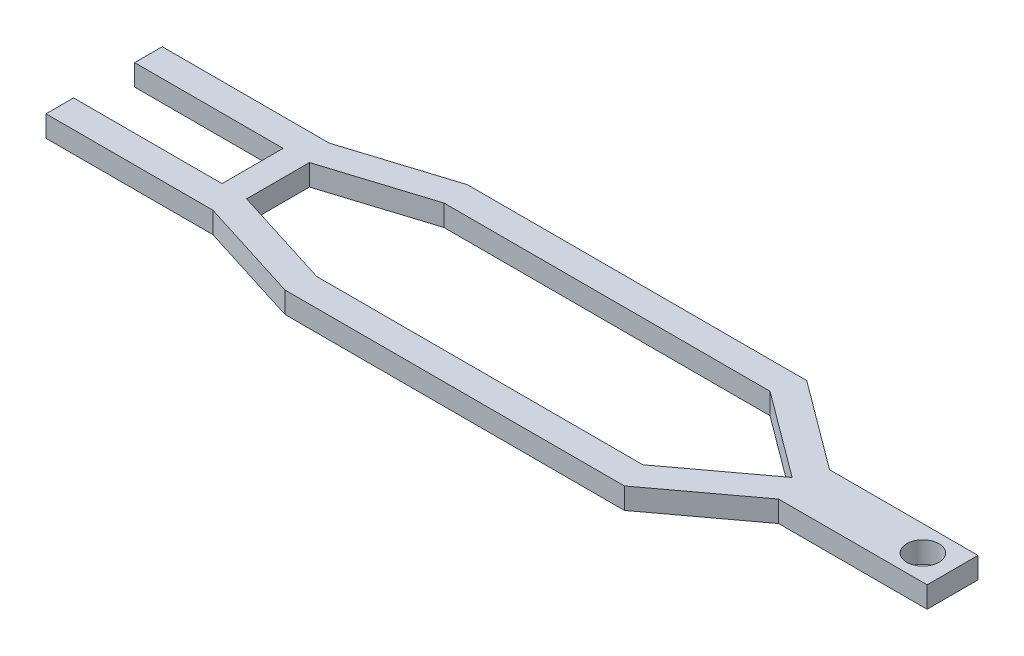
ISO-10303-21;
HEADER;
FILE_DESCRIPTION(('STEP AP214'),'2;1');
FILE_NAME('part.step','',(''),(''),'','','');
FILE_SCHEMA(('AUTOMOTIVE_DESIGN { 1 0 10303 214 1 1 1 1 }'));
ENDSEC;
DATA;
#1=APPLICATION_CONTEXT('core data for automotive mechanical design processes');
#2=APPLICATION_PROTOCOL_DEFINITION('international standard','automotive_design',2000,#1);
#3=PRODUCT_CONTEXT('',#1,'mechanical');
#4=PRODUCT('Part','Part','',(#3));
#5=PRODUCT_RELATED_PRODUCT_CATEGORY('part','',(#4));
#6=PRODUCT_DEFINITION_FORMATION('','',#4);
#7=PRODUCT_DEFINITION_CONTEXT('part definition',#1,'design');
#8=PRODUCT_DEFINITION('design','',#6,#7);
#9=PRODUCT_DEFINITION_SHAPE('','',#8);
#10=(LENGTH_UNIT() NAMED_UNIT(*) SI_UNIT(.MILLI.,.METRE.));
#11=(NAMED_UNIT(*) PLANE_ANGLE_UNIT() SI_UNIT($,.RADIAN.));
#12=(NAMED_UNIT(*) SI_UNIT($,.STERADIAN.) SOLID_ANGLE_UNIT());
#13=UNCERTAINTY_MEASURE_WITH_UNIT(LENGTH_MEASURE(1.E-05),#10,'distance_accuracy_value','');
#14=(GEOMETRIC_REPRESENTATION_CONTEXT(3) GLOBAL_UNCERTAINTY_ASSIGNED_CONTEXT((#13)) GLOBAL_UNIT_ASSIGNED_CONTEXT((#10,
#11,#12)) REPRESENTATION_CONTEXT('',''));
#15=CARTESIAN_POINT('',(0.,0.,0.));
#16=DIRECTION('',(0.,0.,1.));
#17=DIRECTION('',(1.,0.,0.));
#18=AXIS2_PLACEMENT_3D('',#15,#16,#17);
#19=CARTESIAN_POINT('',(0.,5.,13.7));
#20=DIRECTION('',(1.,0.,0.));
#21=DIRECTION('',(0.,0.,-1.));
#22=AXIS2_PLACEMENT_3D('',#19,#20,#21);
#23=PLANE('',#22);
#24=DIRECTION('',(0.,0.,1.));
#25=VECTOR('',#24,1.);
#26=CARTESIAN_POINT('',(0.,0.,13.7));
#27=LINE('',#26,#25);
#28=CARTESIAN_POINT('',(0.,0.,7.2));
#29=VERTEX_POINT('',#28);
#30=CARTESIAN_POINT('',(0.,0.,13.7));
#31=VERTEX_POINT('',#30);
#32=EDGE_CURVE('E241',#29,#31,#27,.T.);
#33=ORIENTED_EDGE('',*,*,#32,.T.);
#34=DIRECTION('',(0.,-1.,0.));
#35=VECTOR('',#34,1.);
#36=CARTESIAN_POINT('',(0.,5.,13.7));
#37=LINE('',#36,#35);
#38=CARTESIAN_POINT('',(0.,5.,13.7));
#39=VERTEX_POINT('',#38);
#40=EDGE_CURVE('E11',#39,#31,#37,.T.);
#41=ORIENTED_EDGE('',*,*,#40,.F.);
#42=DIRECTION('',(0.,0.,1.));
#43=VECTOR('',#42,1.);
#44=CARTESIAN_POINT('',(0.,5.,13.7));
#45=LINE('',#44,#43);
#46=CARTESIAN_POINT('',(0.,5.,7.2));
#47=VERTEX_POINT('',#46);
#48=EDGE_CURVE('E251',#47,#39,#45,.T.);
#49=ORIENTED_EDGE('',*,*,#48,.F.);
#50=DIRECTION('',(0.,-1.,0.));
#51=VECTOR('',#50,1.);
#52=CARTESIAN_POINT('',(0.,5.,7.2));
#53=LINE('',#52,#51);
#54=EDGE_CURVE('E285',#47,#29,#53,.T.);
#55=ORIENTED_EDGE('',*,*,#54,.T.);
#56=EDGE_LOOP('',(#33,#41,#49,#55));
#57=FACE_BOUND('',#56,.T.);
#58=ADVANCED_FACE('F32',(#57),#23,.F.);
#59=CARTESIAN_POINT('',(0.,5.,13.7));
#60=DIRECTION('',(0.,0.,-1.));
#61=DIRECTION('',(-1.,0.,0.));
#62=AXIS2_PLACEMENT_3D('',#59,#60,#61);
#63=PLANE('',#62);
#64=DIRECTION('',(1.,0.,0.));
#65=VECTOR('',#64,1.);
#66=CARTESIAN_POINT('',(0.,0.,13.7));
#67=LINE('',#66,#65);
#68=CARTESIAN_POINT('',(39.3361125780459,0.,13.7));
#69=VERTEX_POINT('',#68);
#70=EDGE_CURVE('E288',#31,#69,#67,.T.);
#71=ORIENTED_EDGE('',*,*,#70,.T.);
#72=DIRECTION('',(0.,-1.,0.));
#73=VECTOR('',#72,1.);
#74=CARTESIAN_POINT('',(39.3361125780459,5.,13.7));
#75=LINE('',#74,#73);
#76=CARTESIAN_POINT('',(39.3361125780459,5.,13.7));
#77=VERTEX_POINT('',#76);
#78=EDGE_CURVE('E39',#77,#69,#75,.T.);
#79=ORIENTED_EDGE('',*,*,#78,.F.);
#80=DIRECTION('',(1.,0.,0.));
#81=VECTOR('',#80,1.);
#82=CARTESIAN_POINT('',(0.,5.,13.7));
#83=LINE('',#82,#81);
#84=EDGE_CURVE('E254',#39,#77,#83,.T.);
#85=ORIENTED_EDGE('',*,*,#84,.F.);
#86=ORIENTED_EDGE('',*,*,#40,.T.);
#87=EDGE_LOOP('',(#71,#79,#85,#86));
#88=FACE_BOUND('',#87,.T.);
#89=ADVANCED_FACE('F383',(#88),#63,.F.);
#90=CARTESIAN_POINT('',(39.3361125780459,5.,13.7));
#91=DIRECTION('',(0.300066197862969,0.,-0.953918380628061));
#92=DIRECTION('',(-0.953918380628061,0.,-0.300066197862969));
#93=AXIS2_PLACEMENT_3D('',#90,#91,#92);
#94=PLANE('',#93);
#95=DIRECTION('',(0.953918380628061,0.,0.300066197862969));
#96=VECTOR('',#95,1.);
#97=CARTESIAN_POINT('',(39.3361125780459,0.,13.7));
#98=LINE('',#97,#96);
#99=CARTESIAN_POINT('',(64.1325189106803,0.,21.5));
#100=VERTEX_POINT('',#99);
#101=EDGE_CURVE('E290',#69,#100,#98,.T.);
#102=ORIENTED_EDGE('',*,*,#101,.T.);
#103=DIRECTION('',(0.,-1.,0.));
#104=VECTOR('',#103,1.);
#105=CARTESIAN_POINT('',(64.1325189106803,5.,21.5));
#106=LINE('',#105,#104);
#107=CARTESIAN_POINT('',(64.1325189106803,5.,21.5));
#108=VERTEX_POINT('',#107);
#109=EDGE_CURVE('E355',#108,#100,#106,.T.);
#110=ORIENTED_EDGE('',*,*,#109,.F.);
#111=DIRECTION('',(0.953918380628061,0.,0.300066197862969));
#112=VECTOR('',#111,1.);
#113=CARTESIAN_POINT('',(39.3361125780459,5.,13.7));
#114=LINE('',#113,#112);
#115=EDGE_CURVE('E257',#77,#108,#114,.T.);
#116=ORIENTED_EDGE('',*,*,#115,.F.);
#117=ORIENTED_EDGE('',*,*,#78,.T.);
#118=EDGE_LOOP('',(#102,#110,#116,#117));
#119=FACE_BOUND('',#118,.T.);
#120=ADVANCED_FACE('F362',(#119),#94,.F.);
#121=CARTESIAN_POINT('',(64.1325189106803,5.,21.5));
#122=DIRECTION('',(0.,0.,-1.));
#123=DIRECTION('',(-1.,0.,0.));
#124=AXIS2_PLACEMENT_3D('',#121,#122,#123);
#125=PLANE('',#124);
#126=DIRECTION('',(1.,0.,0.));
#127=VECTOR('',#126,1.);
#128=CARTESIAN_POINT('',(64.1325189106803,0.,21.5));
#129=LINE('',#128,#127);
#130=CARTESIAN_POINT('',(144.13251891068,0.,21.5));
#131=VERTEX_POINT('',#130);
#132=EDGE_CURVE('E292',#100,#131,#129,.T.);
#133=ORIENTED_EDGE('',*,*,#132,.T.);
#134=DIRECTION('',(0.,-1.,0.));
#135=VECTOR('',#134,1.);
#136=CARTESIAN_POINT('',(144.13251891068,5.,21.5));
#137=LINE('',#136,#135);
#138=CARTESIAN_POINT('',(144.13251891068,5.,21.5));
#139=VERTEX_POINT('',#138);
#140=EDGE_CURVE('E352',#139,#131,#137,.T.);
#141=ORIENTED_EDGE('',*,*,#140,.F.);
#142=DIRECTION('',(1.,0.,0.));
#143=VECTOR('',#142,1.);
#144=CARTESIAN_POINT('',(64.1325189106803,5.,21.5));
#145=LINE('',#144,#143);
#146=EDGE_CURVE('E259',#108,#139,#145,.T.);
#147=ORIENTED_EDGE('',*,*,#146,.F.);
#148=ORIENTED_EDGE('',*,*,#109,.T.);
#149=EDGE_LOOP('',(#133,#141,#147,#148));
#150=FACE_BOUND('',#149,.T.);
#151=ADVANCED_FACE('F371',(#150),#125,.F.);
#152=CARTESIAN_POINT('',(144.13251891068,5.,21.5));
#153=DIRECTION('',(-0.596285393189233,0.,-0.802772526852509));
#154=DIRECTION('',(-0.802772526852509,0.,0.596285393189233));
#155=AXIS2_PLACEMENT_3D('',#152,#153,#154);
#156=PLANE('',#155);
#157=DIRECTION('',(0.802772526852509,0.,-0.596285393189233));
#158=VECTOR('',#157,1.);
#159=CARTESIAN_POINT('',(144.13251891068,0.,21.5));
#160=LINE('',#159,#158);
#161=CARTESIAN_POINT('',(165.,0.,6.));
#162=VERTEX_POINT('',#161);
#163=EDGE_CURVE('E294',#131,#162,#160,.T.);
#164=ORIENTED_EDGE('',*,*,#163,.T.);
#165=DIRECTION('',(0.,-1.,0.));
#166=VECTOR('',#165,1.);
#167=CARTESIAN_POINT('',(165.,5.,6.));
#168=LINE('',#167,#166);
#169=CARTESIAN_POINT('',(165.,5.,6.));
#170=VERTEX_POINT('',#169);
#171=EDGE_CURVE('E349',#170,#162,#168,.T.);
#172=ORIENTED_EDGE('',*,*,#171,.F.);
#173=DIRECTION('',(0.802772526852509,0.,-0.596285393189233));
#174=VECTOR('',#173,1.);
#175=CARTESIAN_POINT('',(144.13251891068,5.,21.5));
#176=LINE('',#175,#174);
#177=EDGE_CURVE('E261',#139,#170,#176,.T.);
#178=ORIENTED_EDGE('',*,*,#177,.F.);
#179=ORIENTED_EDGE('',*,*,#140,.T.);
#180=EDGE_LOOP('',(#164,#172,#178,#179));
#181=FACE_BOUND('',#180,.T.);
#182=ADVANCED_FACE('F375',(#181),#156,.F.);
#183=CARTESIAN_POINT('',(165.,5.,6.));
#184=DIRECTION('',(0.,0.,-1.));
#185=DIRECTION('',(-1.,0.,0.));
#186=AXIS2_PLACEMENT_3D('',#183,#184,#185);
#187=PLANE('',#186);
#188=DIRECTION('',(1.,0.,0.));
#189=VECTOR('',#188,1.);
#190=CARTESIAN_POINT('',(165.,0.,6.));
#191=LINE('',#190,#189);
#192=CARTESIAN_POINT('',(200.,0.,6.));
#193=VERTEX_POINT('',#192);
#194=EDGE_CURVE('E296',#162,#193,#191,.T.);
#195=ORIENTED_EDGE('',*,*,#194,.T.);
#196=DIRECTION('',(0.,-1.,0.));
#197=VECTOR('',#196,1.);
#198=CARTESIAN_POINT('',(200.,5.,6.));
#199=LINE('',#198,#197);
#200=CARTESIAN_POINT('',(200.,5.,6.));
#201=VERTEX_POINT('',#200);
#202=EDGE_CURVE('E346',#201,#193,#199,.T.);
#203=ORIENTED_EDGE('',*,*,#202,.F.);
#204=DIRECTION('',(1.,0.,0.));
#205=VECTOR('',#204,1.);
#206=CARTESIAN_POINT('',(165.,5.,6.));
#207=LINE('',#206,#205);
#208=EDGE_CURVE('E263',#170,#201,#207,.T.);
#209=ORIENTED_EDGE('',*,*,#208,.F.);
#210=ORIENTED_EDGE('',*,*,#171,.T.);
#211=EDGE_LOOP('',(#195,#203,#209,#210));
#212=FACE_BOUND('',#211,.T.);
#213=ADVANCED_FACE('F436',(#212),#187,.F.);
#214=CARTESIAN_POINT('',(200.,5.,6.));
#215=DIRECTION('',(-1.,0.,0.));
#216=DIRECTION('',(0.,0.,1.));
#217=AXIS2_PLACEMENT_3D('',#214,#215,#216);
#218=PLANE('',#217);
#219=DIRECTION('',(0.,0.,-1.));
#220=VECTOR('',#219,1.);
#221=CARTESIAN_POINT('',(200.,0.,6.));
#222=LINE('',#221,#220);
#223=CARTESIAN_POINT('',(200.,0.,-6.));
#224=VERTEX_POINT('',#223);
#225=EDGE_CURVE('E298',#193,#224,#222,.T.);
#226=ORIENTED_EDGE('',*,*,#225,.T.);
#227=DIRECTION('',(0.,-1.,0.));
#228=VECTOR('',#227,1.);
#229=CARTESIAN_POINT('',(200.,5.,-6.));
#230=LINE('',#229,#228);
#231=CARTESIAN_POINT('',(200.,5.,-6.));
#232=VERTEX_POINT('',#231);
#233=EDGE_CURVE('E343',#232,#224,#230,.T.);
#234=ORIENTED_EDGE('',*,*,#233,.F.);
#235=DIRECTION('',(0.,0.,-1.));
#236=VECTOR('',#235,1.);
#237=CARTESIAN_POINT('',(200.,5.,6.));
#238=LINE('',#237,#236);
#239=EDGE_CURVE('E265',#201,#232,#238,.T.);
#240=ORIENTED_EDGE('',*,*,#239,.F.);
#241=ORIENTED_EDGE('',*,*,#202,.T.);
#242=EDGE_LOOP('',(#226,#234,#240,#241));
#243=FACE_BOUND('',#242,.T.);
#244=ADVANCED_FACE('F433',(#243),#218,.F.);
#245=CARTESIAN_POINT('',(165.,5.,-6.));
#246=DIRECTION('',(0.,0.,1.));
#247=DIRECTION('',(1.,0.,0.));
#248=AXIS2_PLACEMENT_3D('',#245,#246,#247);
#249=PLANE('',#248);
#250=DIRECTION('',(-1.,0.,0.));
#251=VECTOR('',#250,1.);
#252=CARTESIAN_POINT('',(165.,0.,-6.));
#253=LINE('',#252,#251);
#254=CARTESIAN_POINT('',(165.,0.,-6.));
#255=VERTEX_POINT('',#254);
#256=EDGE_CURVE('E300',#224,#255,#253,.T.);
#257=ORIENTED_EDGE('',*,*,#256,.T.);
#258=DIRECTION('',(0.,-1.,0.));
#259=VECTOR('',#258,1.);
#260=CARTESIAN_POINT('',(165.,5.,-6.));
#261=LINE('',#260,#259);
#262=CARTESIAN_POINT('',(165.,5.,-6.));
#263=VERTEX_POINT('',#262);
#264=EDGE_CURVE('E340',#263,#255,#261,.T.);
#265=ORIENTED_EDGE('',*,*,#264,.F.);
#266=DIRECTION('',(-1.,0.,0.));
#267=VECTOR('',#266,1.);
#268=CARTESIAN_POINT('',(165.,5.,-6.));
#269=LINE('',#268,#267);
#270=EDGE_CURVE('E267',#232,#263,#269,.T.);
#271=ORIENTED_EDGE('',*,*,#270,.F.);
#272=ORIENTED_EDGE('',*,*,#233,.T.);
#273=EDGE_LOOP('',(#257,#265,#271,#272));
#274=FACE_BOUND('',#273,.T.);
#275=ADVANCED_FACE('F429',(#274),#249,.F.);
#276=CARTESIAN_POINT('',(144.13251891068,5.,-21.5));
#277=DIRECTION('',(-0.596285393189233,0.,0.802772526852509));
#278=DIRECTION('',(0.802772526852509,0.,0.596285393189233));
#279=AXIS2_PLACEMENT_3D('',#276,#277,#278);
#280=PLANE('',#279);
#281=DIRECTION('',(-0.802772526852509,0.,-0.596285393189233));
#282=VECTOR('',#281,1.);
#283=CARTESIAN_POINT('',(144.13251891068,0.,-21.5));
#284=LINE('',#283,#282);
#285=CARTESIAN_POINT('',(144.13251891068,0.,-21.5));
#286=VERTEX_POINT('',#285);
#287=EDGE_CURVE('E302',#255,#286,#284,.T.);
#288=ORIENTED_EDGE('',*,*,#287,.T.);
#289=DIRECTION('',(0.,-1.,0.));
#290=VECTOR('',#289,1.);
#291=CARTESIAN_POINT('',(144.13251891068,5.,-21.5));
#292=LINE('',#291,#290);
#293=CARTESIAN_POINT('',(144.13251891068,5.,-21.5));
#294=VERTEX_POINT('',#293);
#295=EDGE_CURVE('E337',#294,#286,#292,.T.);
#296=ORIENTED_EDGE('',*,*,#295,.F.);
#297=DIRECTION('',(-0.802772526852509,0.,-0.596285393189233));
#298=VECTOR('',#297,1.);
#299=CARTESIAN_POINT('',(144.13251891068,5.,-21.5));
#300=LINE('',#299,#298);
#301=EDGE_CURVE('E269',#263,#294,#300,.T.);
#302=ORIENTED_EDGE('',*,*,#301,.F.);
#303=ORIENTED_EDGE('',*,*,#264,.T.);
#304=EDGE_LOOP('',(#288,#296,#302,#303));
#305=FACE_BOUND('',#304,.T.);
#306=ADVANCED_FACE('F425',(#305),#280,.F.);
#307=CARTESIAN_POINT('',(64.1325189106803,5.,-21.5));
#308=DIRECTION('',(0.,0.,1.));
#309=DIRECTION('',(1.,0.,0.));
#310=AXIS2_PLACEMENT_3D('',#307,#308,#309);
#311=PLANE('',#310);
#312=DIRECTION('',(-1.,0.,0.));
#313=VECTOR('',#312,1.);
#314=CARTESIAN_POINT('',(64.1325189106803,0.,-21.5));
#315=LINE('',#314,#313);
#316=CARTESIAN_POINT('',(64.1325189106803,0.,-21.5));
#317=VERTEX_POINT('',#316);
#318=EDGE_CURVE('E304',#286,#317,#315,.T.);
#319=ORIENTED_EDGE('',*,*,#318,.T.);
#320=DIRECTION('',(0.,-1.,0.));
#321=VECTOR('',#320,1.);
#322=CARTESIAN_POINT('',(64.1325189106803,5.,-21.5));
#323=LINE('',#322,#321);
#324=CARTESIAN_POINT('',(64.1325189106803,5.,-21.5));
#325=VERTEX_POINT('',#324);
#326=EDGE_CURVE('E334',#325,#317,#323,.T.);
#327=ORIENTED_EDGE('',*,*,#326,.F.);
#328=DIRECTION('',(-1.,0.,0.));
#329=VECTOR('',#328,1.);
#330=CARTESIAN_POINT('',(64.1325189106803,5.,-21.5));
#331=LINE('',#330,#329);
#332=EDGE_CURVE('E271',#294,#325,#331,.T.);
#333=ORIENTED_EDGE('',*,*,#332,.F.);
#334=ORIENTED_EDGE('',*,*,#295,.T.);
#335=EDGE_LOOP('',(#319,#327,#333,#334));
#336=FACE_BOUND('',#335,.T.);
#337=ADVANCED_FACE('F420',(#336),#311,.F.);
#338=CARTESIAN_POINT('',(39.3361125780459,5.,-13.7));
#339=DIRECTION('',(0.300066197862969,0.,0.953918380628061));
#340=DIRECTION('',(0.953918380628061,0.,-0.300066197862969));
#341=AXIS2_PLACEMENT_3D('',#338,#339,#340);
#342=PLANE('',#341);
#343=DIRECTION('',(-0.95391838062806,0.,0.300066197862969));
#344=VECTOR('',#343,1.);
#345=CARTESIAN_POINT('',(39.3361125780459,0.,-13.7));
#346=LINE('',#345,#344);
#347=CARTESIAN_POINT('',(39.3361125780459,0.,-13.7));
#348=VERTEX_POINT('',#347);
#349=EDGE_CURVE('E306',#317,#348,#346,.T.);
#350=ORIENTED_EDGE('',*,*,#349,.T.);
#351=DIRECTION('',(0.,-1.,0.));
#352=VECTOR('',#351,1.);
#353=CARTESIAN_POINT('',(39.3361125780459,5.,-13.7));
#354=LINE('',#353,#352);
#355=CARTESIAN_POINT('',(39.3361125780459,5.,-13.7));
#356=VERTEX_POINT('',#355);
#357=EDGE_CURVE('E331',#356,#348,#354,.T.);
#358=ORIENTED_EDGE('',*,*,#357,.F.);
#359=DIRECTION('',(-0.95391838062806,0.,0.300066197862969));
#360=VECTOR('',#359,1.);
#361=CARTESIAN_POINT('',(39.3361125780459,5.,-13.7));
#362=LINE('',#361,#360);
#363=EDGE_CURVE('E273',#325,#356,#362,.T.);
#364=ORIENTED_EDGE('',*,*,#363,.F.);
#365=ORIENTED_EDGE('',*,*,#326,.T.);
#366=EDGE_LOOP('',(#350,#358,#364,#365));
#367=FACE_BOUND('',#366,.T.);
#368=ADVANCED_FACE('F414',(#367),#342,.F.);
#369=CARTESIAN_POINT('',(0.,5.,-13.7));
#370=DIRECTION('',(0.,0.,1.));
#371=DIRECTION('',(1.,0.,0.));
#372=AXIS2_PLACEMENT_3D('',#369,#370,#371);
#373=PLANE('',#372);
#374=DIRECTION('',(-1.,0.,0.));
#375=VECTOR('',#374,1.);
#376=CARTESIAN_POINT('',(0.,0.,-13.7));
#377=LINE('',#376,#375);
#378=CARTESIAN_POINT('',(0.,0.,-13.7));
#379=VERTEX_POINT('',#378);
#380=EDGE_CURVE('E308',#348,#379,#377,.T.);
#381=ORIENTED_EDGE('',*,*,#380,.T.);
#382=DIRECTION('',(0.,-1.,0.));
#383=VECTOR('',#382,1.);
#384=CARTESIAN_POINT('',(0.,5.,-13.7));
#385=LINE('',#384,#383);
#386=CARTESIAN_POINT('',(0.,5.,-13.7));
#387=VERTEX_POINT('',#386);
#388=EDGE_CURVE('E328',#387,#379,#385,.T.);
#389=ORIENTED_EDGE('',*,*,#388,.F.);
#390=DIRECTION('',(-1.,0.,0.));
#391=VECTOR('',#390,1.);
#392=CARTESIAN_POINT('',(0.,5.,-13.7));
#393=LINE('',#392,#391);
#394=EDGE_CURVE('E275',#356,#387,#393,.T.);
#395=ORIENTED_EDGE('',*,*,#394,.F.);
#396=ORIENTED_EDGE('',*,*,#357,.T.);
#397=EDGE_LOOP('',(#381,#389,#395,#396));
#398=FACE_BOUND('',#397,.T.);
#399=ADVANCED_FACE('F410',(#398),#373,.F.);
#400=CARTESIAN_POINT('',(0.,5.,-13.7));
#401=DIRECTION('',(1.,0.,0.));
#402=DIRECTION('',(0.,0.,-1.));
#403=AXIS2_PLACEMENT_3D('',#400,#401,#402);
#404=PLANE('',#403);
#405=DIRECTION('',(0.,0.,1.));
#406=VECTOR('',#405,1.);
#407=CARTESIAN_POINT('',(0.,0.,-13.7));
#408=LINE('',#407,#406);
#409=CARTESIAN_POINT('',(0.,0.,-7.2));
#410=VERTEX_POINT('',#409);
#411=EDGE_CURVE('E310',#379,#410,#408,.T.);
#412=ORIENTED_EDGE('',*,*,#411,.T.);
#413=DIRECTION('',(0.,-1.,0.));
#414=VECTOR('',#413,1.);
#415=CARTESIAN_POINT('',(0.,5.,-7.2));
#416=LINE('',#415,#414);
#417=CARTESIAN_POINT('',(0.,5.,-7.2));
#418=VERTEX_POINT('',#417);
#419=EDGE_CURVE('E325',#418,#410,#416,.T.);
#420=ORIENTED_EDGE('',*,*,#419,.F.);
#421=DIRECTION('',(0.,0.,1.));
#422=VECTOR('',#421,1.);
#423=CARTESIAN_POINT('',(0.,5.,-13.7));
#424=LINE('',#423,#422);
#425=EDGE_CURVE('E277',#387,#418,#424,.T.);
#426=ORIENTED_EDGE('',*,*,#425,.F.);
#427=ORIENTED_EDGE('',*,*,#388,.T.);
#428=EDGE_LOOP('',(#412,#420,#426,#427));
#429=FACE_BOUND('',#428,.T.);
#430=ADVANCED_FACE('F405',(#429),#404,.F.);
#431=CARTESIAN_POINT('',(0.,5.,-7.2));
#432=DIRECTION('',(0.,0.,-1.));
#433=DIRECTION('',(-1.,0.,0.));
#434=AXIS2_PLACEMENT_3D('',#431,#432,#433);
#435=PLANE('',#434);
#436=DIRECTION('',(1.,0.,0.));
#437=VECTOR('',#436,1.);
#438=CARTESIAN_POINT('',(0.,0.,-7.2));
#439=LINE('',#438,#437);
#440=CARTESIAN_POINT('',(35.,0.,-7.2));
#441=VERTEX_POINT('',#440);
#442=EDGE_CURVE('E312',#410,#441,#439,.T.);
#443=ORIENTED_EDGE('',*,*,#442,.T.);
#444=DIRECTION('',(0.,-1.,0.));
#445=VECTOR('',#444,1.);
#446=CARTESIAN_POINT('',(35.,5.,-7.2));
#447=LINE('',#446,#445);
#448=CARTESIAN_POINT('',(35.,5.,-7.2));
#449=VERTEX_POINT('',#448);
#450=EDGE_CURVE('E322',#449,#441,#447,.T.);
#451=ORIENTED_EDGE('',*,*,#450,.F.);
#452=DIRECTION('',(1.,0.,0.));
#453=VECTOR('',#452,1.);
#454=CARTESIAN_POINT('',(0.,5.,-7.2));
#455=LINE('',#454,#453);
#456=EDGE_CURVE('E279',#418,#449,#455,.T.);
#457=ORIENTED_EDGE('',*,*,#456,.F.);
#458=ORIENTED_EDGE('',*,*,#419,.T.);
#459=EDGE_LOOP('',(#443,#451,#457,#458));
#460=FACE_BOUND('',#459,.T.);
#461=ADVANCED_FACE('F399',(#460),#435,.F.);
#462=CARTESIAN_POINT('',(35.,5.,7.2));
#463=DIRECTION('',(1.,0.,0.));
#464=DIRECTION('',(0.,0.,-1.));
#465=AXIS2_PLACEMENT_3D('',#462,#463,#464);
#466=PLANE('',#465);
#467=DIRECTION('',(0.,0.,1.));
#468=VECTOR('',#467,1.);
#469=CARTESIAN_POINT('',(35.,0.,7.2));
#470=LINE('',#469,#468);
#471=CARTESIAN_POINT('',(35.,0.,7.2));
#472=VERTEX_POINT('',#471);
#473=EDGE_CURVE('E314',#441,#472,#470,.T.);
#474=ORIENTED_EDGE('',*,*,#473,.T.);
#475=DIRECTION('',(0.,-1.,0.));
#476=VECTOR('',#475,1.);
#477=CARTESIAN_POINT('',(35.,5.,7.2));
#478=LINE('',#477,#476);
#479=CARTESIAN_POINT('',(35.,5.,7.2));
#480=VERTEX_POINT('',#479);
#481=EDGE_CURVE('E319',#480,#472,#478,.T.);
#482=ORIENTED_EDGE('',*,*,#481,.F.);
#483=DIRECTION('',(0.,0.,1.));
#484=VECTOR('',#483,1.);
#485=CARTESIAN_POINT('',(35.,5.,7.2));
#486=LINE('',#485,#484);
#487=EDGE_CURVE('E281',#449,#480,#486,.T.);
#488=ORIENTED_EDGE('',*,*,#487,.F.);
#489=ORIENTED_EDGE('',*,*,#450,.T.);
#490=EDGE_LOOP('',(#474,#482,#488,#489));
#491=FACE_BOUND('',#490,.T.);
#492=ADVANCED_FACE('F395',(#491),#466,.F.);
#493=CARTESIAN_POINT('',(0.,5.,7.2));
#494=DIRECTION('',(0.,0.,1.));
#495=DIRECTION('',(1.,0.,0.));
#496=AXIS2_PLACEMENT_3D('',#493,#494,#495);
#497=PLANE('',#496);
#498=DIRECTION('',(-1.,0.,0.));
#499=VECTOR('',#498,1.);
#500=CARTESIAN_POINT('',(0.,0.,7.2));
#501=LINE('',#500,#499);
#502=EDGE_CURVE('E255',#472,#29,#501,.T.);
#503=ORIENTED_EDGE('',*,*,#502,.T.);
#504=ORIENTED_EDGE('',*,*,#54,.F.);
#505=DIRECTION('',(-1.,0.,0.));
#506=VECTOR('',#505,1.);
#507=CARTESIAN_POINT('',(0.,5.,7.2));
#508=LINE('',#507,#506);
#509=EDGE_CURVE('E283',#480,#47,#508,.T.);
#510=ORIENTED_EDGE('',*,*,#509,.F.);
#511=ORIENTED_EDGE('',*,*,#481,.T.);
#512=EDGE_LOOP('',(#503,#504,#510,#511));
#513=FACE_BOUND('',#512,.T.);
#514=ADVANCED_FACE('F390',(#513),#497,.F.);
#515=CARTESIAN_POINT('',(0.,5.,0.));
#516=DIRECTION('',(0.,-1.,0.));
#517=DIRECTION('',(0.,0.,-1.));
#518=AXIS2_PLACEMENT_3D('',#515,#516,#517);
#519=PLANE('',#518);
#520=CARTESIAN_POINT('',(193.,5.,0.));
#521=DIRECTION('',(0.,1.,0.));
#522=DIRECTION('',(0.,0.,1.));
#523=AXIS2_PLACEMENT_3D('',#520,#521,#522);
#524=CIRCLE('',#523,3.8);
#525=CARTESIAN_POINT('',(193.,5.,3.8));
#526=VERTEX_POINT('',#525);
#527=EDGE_CURVE('E211',#526,#526,#524,.T.);
#528=ORIENTED_EDGE('',*,*,#527,.F.);
#529=EDGE_LOOP('',(#528));
#530=FACE_BOUND('',#529,.T.);
#531=DIRECTION('',(0.802772526852509,0.,-0.596285393189233));
#532=VECTOR('',#531,1.);
#533=CARTESIAN_POINT('',(141.982577640776,5.,15.));
#534=LINE('',#533,#532);
#535=CARTESIAN_POINT('',(141.982577640776,5.,15.));
#536=VERTEX_POINT('',#535);
#537=CARTESIAN_POINT('',(162.176914178827,5.,0.));
#538=VERTEX_POINT('',#537);
#539=EDGE_CURVE('E225',#536,#538,#534,.T.);
#540=ORIENTED_EDGE('',*,*,#539,.F.);
#541=DIRECTION('',(1.,0.,0.));
#542=VECTOR('',#541,1.);
#543=CARTESIAN_POINT('',(65.130733731446,5.,15.));
#544=LINE('',#543,#542);
#545=CARTESIAN_POINT('',(65.130733731446,5.,15.));
#546=VERTEX_POINT('',#545);
#547=EDGE_CURVE('E46',#546,#536,#544,.T.);
#548=ORIENTED_EDGE('',*,*,#547,.F.);
#549=DIRECTION('',(0.95391838062806,0.,0.30006619786297));
#550=VECTOR('',#549,1.);
#551=CARTESIAN_POINT('',(41.,5.,7.40939511232464));
#552=LINE('',#551,#550);
#553=CARTESIAN_POINT('',(41.,5.,7.40939511232464));
#554=VERTEX_POINT('',#553);
#555=EDGE_CURVE('E205',#554,#546,#552,.T.);
#556=ORIENTED_EDGE('',*,*,#555,.F.);
#557=DIRECTION('',(0.,0.,1.));
#558=VECTOR('',#557,1.);
#559=CARTESIAN_POINT('',(41.,5.,-7.40939511232467));
#560=LINE('',#559,#558);
#561=CARTESIAN_POINT('',(41.,5.,-7.40939511232467));
#562=VERTEX_POINT('',#561);
#563=EDGE_CURVE('E208',#562,#554,#560,.T.);
#564=ORIENTED_EDGE('',*,*,#563,.F.);
#565=DIRECTION('',(-0.953918380628061,0.,0.300066197862969));
#566=VECTOR('',#565,1.);
#567=CARTESIAN_POINT('',(65.130733731446,5.,-15.));
#568=LINE('',#567,#566);
#569=CARTESIAN_POINT('',(65.130733731446,5.,-15.));
#570=VERTEX_POINT('',#569);
#571=EDGE_CURVE('E234',#570,#562,#568,.T.);
#572=ORIENTED_EDGE('',*,*,#571,.F.);
#573=DIRECTION('',(-1.,0.,0.));
#574=VECTOR('',#573,1.);
#575=CARTESIAN_POINT('',(141.982577640776,5.,-15.));
#576=LINE('',#575,#574);
#577=CARTESIAN_POINT('',(141.982577640776,5.,-15.));
#578=VERTEX_POINT('',#577);
#579=EDGE_CURVE('E231',#578,#570,#576,.T.);
#580=ORIENTED_EDGE('',*,*,#579,.F.);
#581=DIRECTION('',(-0.802772526852509,0.,-0.596285393189233));
#582=VECTOR('',#581,1.);
#583=CARTESIAN_POINT('',(162.176914178827,5.,0.));
#584=LINE('',#583,#582);
#585=EDGE_CURVE('E228',#538,#578,#584,.T.);
#586=ORIENTED_EDGE('',*,*,#585,.F.);
#587=EDGE_LOOP('',(#540,#548,#556,#564,#572,#580,#586));
#588=FACE_BOUND('',#587,.T.);
#589=ORIENTED_EDGE('',*,*,#48,.T.);
#590=ORIENTED_EDGE('',*,*,#84,.T.);
#591=ORIENTED_EDGE('',*,*,#115,.T.);
#592=ORIENTED_EDGE('',*,*,#146,.T.);
#593=ORIENTED_EDGE('',*,*,#177,.T.);
#594=ORIENTED_EDGE('',*,*,#208,.T.);
#595=ORIENTED_EDGE('',*,*,#239,.T.);
#596=ORIENTED_EDGE('',*,*,#270,.T.);
#597=ORIENTED_EDGE('',*,*,#301,.T.);
#598=ORIENTED_EDGE('',*,*,#332,.T.);
#599=ORIENTED_EDGE('',*,*,#363,.T.);
#600=ORIENTED_EDGE('',*,*,#394,.T.);
#601=ORIENTED_EDGE('',*,*,#425,.T.);
#602=ORIENTED_EDGE('',*,*,#456,.T.);
#603=ORIENTED_EDGE('',*,*,#487,.T.);
#604=ORIENTED_EDGE('',*,*,#509,.T.);
#605=EDGE_LOOP('',(#589,#590,#591,#592,#593,#594,#595,#596,#597,#598,#599,#600,#601,#602,#603,#604));
#606=FACE_BOUND('',#605,.T.);
#607=ADVANCED_FACE('F379',(#530,#588,#606),#519,.F.);
#608=CARTESIAN_POINT('',(0.,0.,0.));
#609=DIRECTION('',(0.,-1.,0.));
#610=DIRECTION('',(0.,0.,-1.));
#611=AXIS2_PLACEMENT_3D('',#608,#609,#610);
#612=PLANE('',#611);
#613=CARTESIAN_POINT('',(193.,0.,0.));
#614=DIRECTION('',(0.,1.,0.));
#615=DIRECTION('',(0.,0.,1.));
#616=AXIS2_PLACEMENT_3D('',#613,#614,#615);
#617=CIRCLE('',#616,3.8);
#618=CARTESIAN_POINT('',(193.,0.,3.8));
#619=VERTEX_POINT('',#618);
#620=EDGE_CURVE('E226',#619,#619,#617,.T.);
#621=ORIENTED_EDGE('',*,*,#620,.T.);
#622=EDGE_LOOP('',(#621));
#623=FACE_BOUND('',#622,.T.);
#624=DIRECTION('',(1.,0.,0.));
#625=VECTOR('',#624,1.);
#626=CARTESIAN_POINT('',(65.130733731446,0.,15.));
#627=LINE('',#626,#625);
#628=CARTESIAN_POINT('',(65.130733731446,0.,15.));
#629=VERTEX_POINT('',#628);
#630=CARTESIAN_POINT('',(141.982577640776,0.,15.));
#631=VERTEX_POINT('',#630);
#632=EDGE_CURVE('E188',#629,#631,#627,.T.);
#633=ORIENTED_EDGE('',*,*,#632,.T.);
#634=DIRECTION('',(0.802772526852509,0.,-0.596285393189233));
#635=VECTOR('',#634,1.);
#636=CARTESIAN_POINT('',(141.982577640776,0.,15.));
#637=LINE('',#636,#635);
#638=CARTESIAN_POINT('',(162.176914178827,0.,0.));
#639=VERTEX_POINT('',#638);
#640=EDGE_CURVE('E197',#631,#639,#637,.T.);
#641=ORIENTED_EDGE('',*,*,#640,.T.);
#642=DIRECTION('',(-0.802772526852509,0.,-0.596285393189233));
#643=VECTOR('',#642,1.);
#644=CARTESIAN_POINT('',(162.176914178827,0.,0.));
#645=LINE('',#644,#643);
#646=CARTESIAN_POINT('',(141.982577640776,0.,-15.));
#647=VERTEX_POINT('',#646);
#648=EDGE_CURVE('E54',#639,#647,#645,.T.);
#649=ORIENTED_EDGE('',*,*,#648,.T.);
#650=DIRECTION('',(-1.,0.,0.));
#651=VECTOR('',#650,1.);
#652=CARTESIAN_POINT('',(141.982577640776,0.,-15.));
#653=LINE('',#652,#651);
#654=CARTESIAN_POINT('',(65.130733731446,0.,-15.));
#655=VERTEX_POINT('',#654);
#656=EDGE_CURVE('E215',#647,#655,#653,.T.);
#657=ORIENTED_EDGE('',*,*,#656,.T.);
#658=DIRECTION('',(-0.953918380628061,0.,0.300066197862969));
#659=VECTOR('',#658,1.);
#660=CARTESIAN_POINT('',(65.130733731446,0.,-15.));
#661=LINE('',#660,#659);
#662=CARTESIAN_POINT('',(41.,0.,-7.40939511232467));
#663=VERTEX_POINT('',#662);
#664=EDGE_CURVE('E218',#655,#663,#661,.T.);
#665=ORIENTED_EDGE('',*,*,#664,.T.);
#666=DIRECTION('',(0.,0.,1.));
#667=VECTOR('',#666,1.);
#668=CARTESIAN_POINT('',(41.,0.,-7.40939511232467));
#669=LINE('',#668,#667);
#670=CARTESIAN_POINT('',(41.,0.,7.40939511232464));
#671=VERTEX_POINT('',#670);
#672=EDGE_CURVE('E221',#663,#671,#669,.T.);
#673=ORIENTED_EDGE('',*,*,#672,.T.);
#674=DIRECTION('',(0.95391838062806,0.,0.30006619786297));
#675=VECTOR('',#674,1.);
#676=CARTESIAN_POINT('',(41.,0.,7.40939511232464));
#677=LINE('',#676,#675);
#678=EDGE_CURVE('E194',#671,#629,#677,.T.);
#679=ORIENTED_EDGE('',*,*,#678,.T.);
#680=EDGE_LOOP('',(#633,#641,#649,#657,#665,#673,#679));
#681=FACE_BOUND('',#680,.T.);
#682=ORIENTED_EDGE('',*,*,#32,.F.);
#683=ORIENTED_EDGE('',*,*,#502,.F.);
#684=ORIENTED_EDGE('',*,*,#473,.F.);
#685=ORIENTED_EDGE('',*,*,#442,.F.);
#686=ORIENTED_EDGE('',*,*,#411,.F.);
#687=ORIENTED_EDGE('',*,*,#380,.F.);
#688=ORIENTED_EDGE('',*,*,#349,.F.);
#689=ORIENTED_EDGE('',*,*,#318,.F.);
#690=ORIENTED_EDGE('',*,*,#287,.F.);
#691=ORIENTED_EDGE('',*,*,#256,.F.);
#692=ORIENTED_EDGE('',*,*,#225,.F.);
#693=ORIENTED_EDGE('',*,*,#194,.F.);
#694=ORIENTED_EDGE('',*,*,#163,.F.);
#695=ORIENTED_EDGE('',*,*,#132,.F.);
#696=ORIENTED_EDGE('',*,*,#101,.F.);
#697=ORIENTED_EDGE('',*,*,#70,.F.);
#698=EDGE_LOOP('',(#682,#683,#684,#685,#686,#687,#688,#689,#690,#691,#692,#693,#694,#695,#696,#697));
#699=FACE_BOUND('',#698,.T.);
#700=ADVANCED_FACE('F201',(#623,#681,#699),#612,.T.);
#701=CARTESIAN_POINT('',(65.130733731446,0.,15.));
#702=DIRECTION('',(0.,0.,1.));
#703=DIRECTION('',(1.,0.,0.));
#704=AXIS2_PLACEMENT_3D('',#701,#702,#703);
#705=PLANE('',#704);
#706=ORIENTED_EDGE('',*,*,#547,.T.);
#707=DIRECTION('',(0.,1.,0.));
#708=VECTOR('',#707,1.);
#709=CARTESIAN_POINT('',(141.982577640776,0.,15.));
#710=LINE('',#709,#708);
#711=EDGE_CURVE('E184',#631,#536,#710,.T.);
#712=ORIENTED_EDGE('',*,*,#711,.F.);
#713=ORIENTED_EDGE('',*,*,#632,.F.);
#714=DIRECTION('',(0.,1.,0.));
#715=VECTOR('',#714,1.);
#716=CARTESIAN_POINT('',(65.130733731446,0.,15.));
#717=LINE('',#716,#715);
#718=EDGE_CURVE('E239',#629,#546,#717,.T.);
#719=ORIENTED_EDGE('',*,*,#718,.T.);
#720=EDGE_LOOP('',(#706,#712,#713,#719));
#721=FACE_BOUND('',#720,.T.);
#722=ADVANCED_FACE('F186',(#721),#705,.F.);
#723=CARTESIAN_POINT('',(41.,0.,7.40939511232464));
#724=DIRECTION('',(-0.30006619786297,0.,0.95391838062806));
#725=DIRECTION('',(0.95391838062806,0.,0.30006619786297));
#726=AXIS2_PLACEMENT_3D('',#723,#724,#725);
#727=PLANE('',#726);
#728=ORIENTED_EDGE('',*,*,#555,.T.);
#729=ORIENTED_EDGE('',*,*,#718,.F.);
#730=ORIENTED_EDGE('',*,*,#678,.F.);
#731=DIRECTION('',(0.,1.,0.));
#732=VECTOR('',#731,1.);
#733=CARTESIAN_POINT('',(41.,0.,7.40939511232464));
#734=LINE('',#733,#732);
#735=EDGE_CURVE('E242',#671,#554,#734,.T.);
#736=ORIENTED_EDGE('',*,*,#735,.T.);
#737=EDGE_LOOP('',(#728,#729,#730,#736));
#738=FACE_BOUND('',#737,.T.);
#739=ADVANCED_FACE('F572',(#738),#727,.F.);
#740=CARTESIAN_POINT('',(41.,0.,-7.40939511232467));
#741=DIRECTION('',(-1.,0.,0.));
#742=DIRECTION('',(0.,0.,1.));
#743=AXIS2_PLACEMENT_3D('',#740,#741,#742);
#744=PLANE('',#743);
#745=ORIENTED_EDGE('',*,*,#563,.T.);
#746=ORIENTED_EDGE('',*,*,#735,.F.);
#747=ORIENTED_EDGE('',*,*,#672,.F.);
#748=DIRECTION('',(0.,1.,0.));
#749=VECTOR('',#748,1.);
#750=CARTESIAN_POINT('',(41.,0.,-7.40939511232467));
#751=LINE('',#750,#749);
#752=EDGE_CURVE('E244',#663,#562,#751,.T.);
#753=ORIENTED_EDGE('',*,*,#752,.T.);
#754=EDGE_LOOP('',(#745,#746,#747,#753));
#755=FACE_BOUND('',#754,.T.);
#756=ADVANCED_FACE('F581',(#755),#744,.F.);
#757=CARTESIAN_POINT('',(65.130733731446,0.,-15.));
#758=DIRECTION('',(-0.300066197862969,0.,-0.953918380628061));
#759=DIRECTION('',(-0.953918380628061,0.,0.300066197862969));
#760=AXIS2_PLACEMENT_3D('',#757,#758,#759);
#761=PLANE('',#760);
#762=ORIENTED_EDGE('',*,*,#571,.T.);
#763=ORIENTED_EDGE('',*,*,#752,.F.);
#764=ORIENTED_EDGE('',*,*,#664,.F.);
#765=DIRECTION('',(0.,1.,0.));
#766=VECTOR('',#765,1.);
#767=CARTESIAN_POINT('',(65.130733731446,0.,-15.));
#768=LINE('',#767,#766);
#769=EDGE_CURVE('E246',#655,#570,#768,.T.);
#770=ORIENTED_EDGE('',*,*,#769,.T.);
#771=EDGE_LOOP('',(#762,#763,#764,#770));
#772=FACE_BOUND('',#771,.T.);
#773=ADVANCED_FACE('F591',(#772),#761,.F.);
#774=CARTESIAN_POINT('',(141.982577640776,0.,-15.));
#775=DIRECTION('',(0.,0.,-1.));
#776=DIRECTION('',(-1.,0.,0.));
#777=AXIS2_PLACEMENT_3D('',#774,#775,#776);
#778=PLANE('',#777);
#779=ORIENTED_EDGE('',*,*,#579,.T.);
#780=ORIENTED_EDGE('',*,*,#769,.F.);
#781=ORIENTED_EDGE('',*,*,#656,.F.);
#782=DIRECTION('',(0.,1.,0.));
#783=VECTOR('',#782,1.);
#784=CARTESIAN_POINT('',(141.982577640776,0.,-15.));
#785=LINE('',#784,#783);
#786=EDGE_CURVE('E248',#647,#578,#785,.T.);
#787=ORIENTED_EDGE('',*,*,#786,.T.);
#788=EDGE_LOOP('',(#779,#780,#781,#787));
#789=FACE_BOUND('',#788,.T.);
#790=ADVANCED_FACE('F601',(#789),#778,.F.);
#791=CARTESIAN_POINT('',(162.176914178827,0.,0.));
#792=DIRECTION('',(0.596285393189233,0.,-0.802772526852509));
#793=DIRECTION('',(-0.802772526852509,0.,-0.596285393189233));
#794=AXIS2_PLACEMENT_3D('',#791,#792,#793);
#795=PLANE('',#794);
#796=ORIENTED_EDGE('',*,*,#585,.T.);
#797=ORIENTED_EDGE('',*,*,#786,.F.);
#798=ORIENTED_EDGE('',*,*,#648,.F.);
#799=DIRECTION('',(0.,1.,0.));
#800=VECTOR('',#799,1.);
#801=CARTESIAN_POINT('',(162.176914178827,0.,0.));
#802=LINE('',#801,#800);
#803=EDGE_CURVE('E193',#639,#538,#802,.T.);
#804=ORIENTED_EDGE('',*,*,#803,.T.);
#805=EDGE_LOOP('',(#796,#797,#798,#804));
#806=FACE_BOUND('',#805,.T.);
#807=ADVANCED_FACE('F611',(#806),#795,.F.);
#808=CARTESIAN_POINT('',(141.982577640776,0.,15.));
#809=DIRECTION('',(0.596285393189233,0.,0.802772526852509));
#810=DIRECTION('',(0.802772526852509,0.,-0.596285393189233));
#811=AXIS2_PLACEMENT_3D('',#808,#809,#810);
#812=PLANE('',#811);
#813=ORIENTED_EDGE('',*,*,#539,.T.);
#814=ORIENTED_EDGE('',*,*,#803,.F.);
#815=ORIENTED_EDGE('',*,*,#640,.F.);
#816=ORIENTED_EDGE('',*,*,#711,.T.);
#817=EDGE_LOOP('',(#813,#814,#815,#816));
#818=FACE_BOUND('',#817,.T.);
#819=ADVANCED_FACE('F198',(#818),#812,.F.);
#820=CARTESIAN_POINT('',(193.,0.,0.));
#821=DIRECTION('',(0.,1.,0.));
#822=DIRECTION('',(0.,0.,1.));
#823=AXIS2_PLACEMENT_3D('',#820,#821,#822);
#824=CYLINDRICAL_SURFACE('',#823,3.8);
#825=ORIENTED_EDGE('',*,*,#620,.F.);
#826=EDGE_LOOP('',(#825));
#827=FACE_BOUND('',#826,.T.);
#828=ORIENTED_EDGE('',*,*,#527,.T.);
#829=EDGE_LOOP('',(#828));
#830=FACE_BOUND('',#829,.T.);
#831=ADVANCED_FACE('F629',(#827,#830),#824,.F.);
#832=CLOSED_SHELL('',(#58,#89,#120,#151,#182,#213,#244,#275,#306,#337,#368,#399,#430,#461,#492,
#514,#607,#700,#722,#739,#756,#773,#790,#807,#819,#831));
#833=MANIFOLD_SOLID_BREP('B2',#832);
#834=ADVANCED_BREP_SHAPE_REPRESENTATION('',(#18,#833),#14);
#835=SHAPE_DEFINITION_REPRESENTATION(#9,#834);
ENDSEC;
END-ISO-10303-21;
